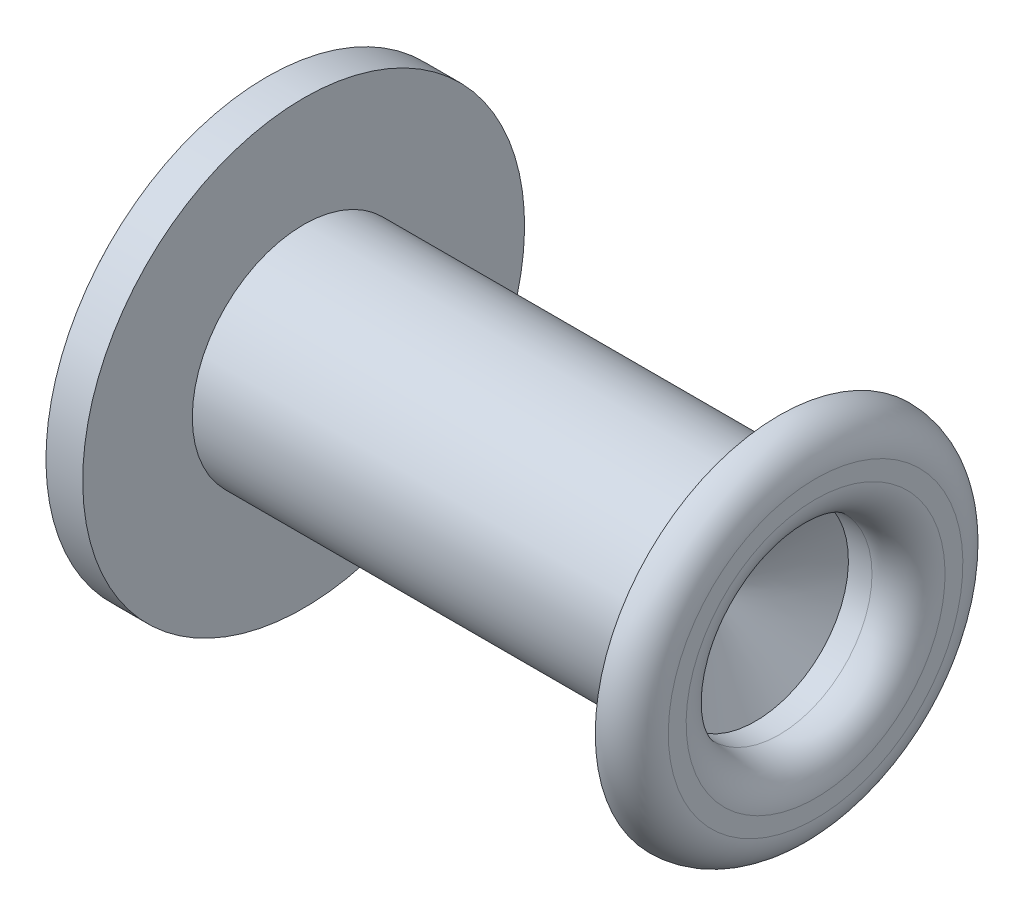
ISO-10303-21;
HEADER;
FILE_DESCRIPTION(('STEP AP214'),'2;1');
FILE_NAME('part.step','',(''),(''),'','','');
FILE_SCHEMA(('AUTOMOTIVE_DESIGN { 1 0 10303 214 1 1 1 1 }'));
ENDSEC;
DATA;
#1=APPLICATION_CONTEXT('core data for automotive mechanical design processes');
#2=APPLICATION_PROTOCOL_DEFINITION('international standard','automotive_design',2000,#1);
#3=PRODUCT_CONTEXT('',#1,'mechanical');
#4=PRODUCT('Part','Part','',(#3));
#5=PRODUCT_RELATED_PRODUCT_CATEGORY('part','',(#4));
#6=PRODUCT_DEFINITION_FORMATION('','',#4);
#7=PRODUCT_DEFINITION_CONTEXT('part definition',#1,'design');
#8=PRODUCT_DEFINITION('design','',#6,#7);
#9=PRODUCT_DEFINITION_SHAPE('','',#8);
#10=(LENGTH_UNIT() NAMED_UNIT(*) SI_UNIT(.MILLI.,.METRE.));
#11=(NAMED_UNIT(*) PLANE_ANGLE_UNIT() SI_UNIT($,.RADIAN.));
#12=(NAMED_UNIT(*) SI_UNIT($,.STERADIAN.) SOLID_ANGLE_UNIT());
#13=UNCERTAINTY_MEASURE_WITH_UNIT(LENGTH_MEASURE(1.E-05),#10,'distance_accuracy_value','');
#14=(GEOMETRIC_REPRESENTATION_CONTEXT(3) GLOBAL_UNCERTAINTY_ASSIGNED_CONTEXT((#13)) GLOBAL_UNIT_ASSIGNED_CONTEXT((#10,
#11,#12)) REPRESENTATION_CONTEXT('',''));
#15=CARTESIAN_POINT('',(0.,0.,0.));
#16=DIRECTION('',(0.,0.,1.));
#17=DIRECTION('',(1.,0.,0.));
#18=AXIS2_PLACEMENT_3D('',#15,#16,#17);
#19=CARTESIAN_POINT('',(12.1208800011914,0.,0.));
#20=DIRECTION('',(1.,0.,0.));
#21=DIRECTION('',(0.,1.,0.));
#22=AXIS2_PLACEMENT_3D('',#19,#20,#21);
#23=CONICAL_SURFACE('',#22,2.00342499931604,1.07167170262021);
#24=CARTESIAN_POINT('',(11.0286799983328,-1.70530256582424E-10,0.));
#25=VERTEX_POINT('',#24);
#26=VERTEX_LOOP('',#25);
#27=FACE_BOUND('',#26,.T.);
#28=CARTESIAN_POINT('',(12.1208800000002,0.,0.));
#29=DIRECTION('',(1.,0.,0.));
#30=DIRECTION('',(0.,1.,0.));
#31=AXIS2_PLACEMENT_3D('',#28,#29,#30);
#32=CIRCLE('',#31,2.003425);
#33=CARTESIAN_POINT('',(12.1208800000002,2.0034249999999,0.));
#34=VERTEX_POINT('',#33);
#35=EDGE_CURVE('E37',#34,#34,#32,.T.);
#36=ORIENTED_EDGE('',*,*,#35,.T.);
#37=EDGE_LOOP('',(#36));
#38=FACE_BOUND('',#37,.T.);
#39=ADVANCED_FACE('F17',(#27,#38),#23,.F.);
#40=CARTESIAN_POINT('',(12.3748800000001,0.,0.));
#41=DIRECTION('',(1.,0.,0.));
#42=DIRECTION('',(0.,1.,0.));
#43=AXIS2_PLACEMENT_3D('',#40,#41,#42);
#44=CYLINDRICAL_SURFACE('',#43,2.003425);
#45=CARTESIAN_POINT('',(12.6288800000001,-1.01585395E-13,0.));
#46=DIRECTION('',(1.,0.,0.));
#47=DIRECTION('',(0.,0.,-1.));
#48=AXIS2_PLACEMENT_3D('',#45,#46,#47);
#49=CIRCLE('',#48,2.003425);
#50=CARTESIAN_POINT('',(12.6288800000001,-1.01585395E-13,-2.003425));
#51=VERTEX_POINT('',#50);
#52=EDGE_CURVE('E39',#51,#51,#49,.F.);
#53=ORIENTED_EDGE('',*,*,#52,.F.);
#54=EDGE_LOOP('',(#53));
#55=FACE_BOUND('',#54,.T.);
#56=ORIENTED_EDGE('',*,*,#35,.F.);
#57=EDGE_LOOP('',(#56));
#58=FACE_BOUND('',#57,.T.);
#59=ADVANCED_FACE('F34',(#55,#58),#44,.F.);
#60=CARTESIAN_POINT('',(12.6288800000001,-1.01585395E-13,0.));
#61=DIRECTION('',(1.,0.,0.));
#62=DIRECTION('',(0.,0.,-1.));
#63=AXIS2_PLACEMENT_3D('',#60,#61,#62);
#64=TOROIDAL_SURFACE('',#63,2.79082500000015,0.787400000000152);
#65=CARTESIAN_POINT('',(13.4162800000002,-1.07926604364801E-13,0.));
#66=DIRECTION('',(1.,0.,0.));
#67=DIRECTION('',(0.,1.,0.));
#68=AXIS2_PLACEMENT_3D('',#65,#66,#67);
#69=CIRCLE('',#68,2.79082500000001);
#70=CARTESIAN_POINT('',(13.4162800000003,2.7908249999999,0.));
#71=VERTEX_POINT('',#70);
#72=EDGE_CURVE('E42',#71,#71,#69,.F.);
#73=ORIENTED_EDGE('',*,*,#72,.F.);
#74=EDGE_LOOP('',(#73));
#75=FACE_BOUND('',#74,.T.);
#76=ORIENTED_EDGE('',*,*,#52,.T.);
#77=EDGE_LOOP('',(#76));
#78=FACE_BOUND('',#77,.T.);
#79=ADVANCED_FACE('F98',(#75,#78),#64,.T.);
#80=CARTESIAN_POINT('',(13.4162800000003,2.98291249999985,0.));
#81=DIRECTION('',(1.,0.,0.));
#82=DIRECTION('',(0.,0.,-1.));
#83=AXIS2_PLACEMENT_3D('',#80,#81,#82);
#84=PLANE('',#83);
#85=ORIENTED_EDGE('',*,*,#72,.T.);
#86=EDGE_LOOP('',(#85));
#87=FACE_BOUND('',#86,.T.);
#88=CARTESIAN_POINT('',(13.4162800000002,-1.07926604364801E-13,0.));
#89=DIRECTION('',(-1.,0.,0.));
#90=DIRECTION('',(0.,1.,0.));
#91=AXIS2_PLACEMENT_3D('',#88,#89,#90);
#92=CIRCLE('',#91,3.17499999999991);
#93=CARTESIAN_POINT('',(13.4162800000003,3.1749999999998,0.));
#94=VERTEX_POINT('',#93);
#95=EDGE_CURVE('E62',#94,#94,#92,.T.);
#96=ORIENTED_EDGE('',*,*,#95,.F.);
#97=EDGE_LOOP('',(#96));
#98=FACE_BOUND('',#97,.T.);
#99=ADVANCED_FACE('F101',(#87,#98),#84,.T.);
#100=CARTESIAN_POINT('',(7.93750000000005,0.,0.));
#101=DIRECTION('',(1.,0.,0.));
#102=DIRECTION('',(0.,1.,0.));
#103=AXIS2_PLACEMENT_3D('',#100,#101,#102);
#104=SPHERICAL_SURFACE('',#103,7.93750000000005);
#105=CARTESIAN_POINT('',(0.,0.,0.));
#106=VERTEX_POINT('',#105);
#107=VERTEX_LOOP('',#106);
#108=FACE_BOUND('',#107,.T.);
#109=CARTESIAN_POINT('',(1.58749999999999,0.,0.));
#110=DIRECTION('',(1.,0.,0.));
#111=DIRECTION('',(0.,1.,0.));
#112=AXIS2_PLACEMENT_3D('',#109,#110,#111);
#113=CIRCLE('',#112,4.7625);
#114=CARTESIAN_POINT('',(1.58750000000003,4.76249999999999,0.));
#115=VERTEX_POINT('',#114);
#116=EDGE_CURVE('E58',#115,#115,#113,.T.);
#117=ORIENTED_EDGE('',*,*,#116,.F.);
#118=EDGE_LOOP('',(#117));
#119=FACE_BOUND('',#118,.T.);
#120=ADVANCED_FACE('F81',(#108,#119),#104,.T.);
#121=CARTESIAN_POINT('',(12.6288800000001,-1.01585395E-13,0.));
#122=DIRECTION('',(1.,0.,0.));
#123=DIRECTION('',(0.,0.,-1.));
#124=AXIS2_PLACEMENT_3D('',#121,#122,#123);
#125=TOROIDAL_SURFACE('',#124,3.17499999999975,0.787400000000152);
#126=CARTESIAN_POINT('',(12.6288800000001,-1.01585395E-13,0.));
#127=DIRECTION('',(1.,0.,0.));
#128=DIRECTION('',(0.,1.,0.));
#129=AXIS2_PLACEMENT_3D('',#126,#127,#128);
#130=CIRCLE('',#129,3.9623999999999);
#131=CARTESIAN_POINT('',(12.6288800000001,3.9623999999998,0.));
#132=VERTEX_POINT('',#131);
#133=EDGE_CURVE('E20',#132,#132,#130,.F.);
#134=ORIENTED_EDGE('',*,*,#133,.F.);
#135=EDGE_LOOP('',(#134));
#136=FACE_BOUND('',#135,.T.);
#137=ORIENTED_EDGE('',*,*,#95,.T.);
#138=EDGE_LOOP('',(#137));
#139=FACE_BOUND('',#138,.T.);
#140=ADVANCED_FACE('F75',(#136,#139),#125,.T.);
#141=CARTESIAN_POINT('',(1.9837400000001,0.,0.));
#142=DIRECTION('',(1.,0.,0.));
#143=DIRECTION('',(0.,1.,0.));
#144=AXIS2_PLACEMENT_3D('',#141,#142,#143);
#145=CYLINDRICAL_SURFACE('',#144,4.7625);
#146=ORIENTED_EDGE('',*,*,#116,.T.);
#147=EDGE_LOOP('',(#146));
#148=FACE_BOUND('',#147,.T.);
#149=CARTESIAN_POINT('',(2.37998000000022,0.,0.));
#150=DIRECTION('',(1.,0.,0.));
#151=DIRECTION('',(0.,1.,0.));
#152=AXIS2_PLACEMENT_3D('',#149,#150,#151);
#153=CIRCLE('',#152,4.7625);
#154=CARTESIAN_POINT('',(2.37998000000025,4.76249999999998,0.));
#155=VERTEX_POINT('',#154);
#156=EDGE_CURVE('E53',#155,#155,#153,.T.);
#157=ORIENTED_EDGE('',*,*,#156,.F.);
#158=EDGE_LOOP('',(#157));
#159=FACE_BOUND('',#158,.T.);
#160=ADVANCED_FACE('F80',(#148,#159),#145,.T.);
#161=CARTESIAN_POINT('',(12.6288800000001,3.18134999999985,0.));
#162=DIRECTION('',(-1.,0.,0.));
#163=DIRECTION('',(0.,0.,1.));
#164=AXIS2_PLACEMENT_3D('',#161,#162,#163);
#165=PLANE('',#164);
#166=CARTESIAN_POINT('',(12.6288800000001,-1.01704819856399E-13,0.));
#167=DIRECTION('',(1.,0.,0.));
#168=DIRECTION('',(0.,1.,0.));
#169=AXIS2_PLACEMENT_3D('',#166,#167,#168);
#170=CIRCLE('',#169,2.40030000000008);
#171=CARTESIAN_POINT('',(12.6288800000001,2.40029999999997,0.));
#172=VERTEX_POINT('',#171);
#173=EDGE_CURVE('E26',#172,#172,#170,.F.);
#174=ORIENTED_EDGE('',*,*,#173,.F.);
#175=EDGE_LOOP('',(#174));
#176=FACE_BOUND('',#175,.T.);
#177=ORIENTED_EDGE('',*,*,#133,.T.);
#178=EDGE_LOOP('',(#177));
#179=FACE_BOUND('',#178,.T.);
#180=ADVANCED_FACE('F118',(#176,#179),#165,.T.);
#181=CARTESIAN_POINT('',(2.37998000000025,3.58140000000008,0.));
#182=DIRECTION('',(1.,0.,0.));
#183=DIRECTION('',(0.,0.,-1.));
#184=AXIS2_PLACEMENT_3D('',#181,#182,#183);
#185=PLANE('',#184);
#186=CARTESIAN_POINT('',(2.37998000000024,0.,0.));
#187=DIRECTION('',(1.,0.,0.));
#188=DIRECTION('',(0.,1.,0.));
#189=AXIS2_PLACEMENT_3D('',#186,#187,#188);
#190=CIRCLE('',#189,2.40030000000008);
#191=CARTESIAN_POINT('',(2.37998000000025,2.40030000000006,0.));
#192=VERTEX_POINT('',#191);
#193=EDGE_CURVE('E11',#192,#192,#190,.T.);
#194=ORIENTED_EDGE('',*,*,#193,.F.);
#195=EDGE_LOOP('',(#194));
#196=FACE_BOUND('',#195,.T.);
#197=ORIENTED_EDGE('',*,*,#156,.T.);
#198=EDGE_LOOP('',(#197));
#199=FACE_BOUND('',#198,.T.);
#200=ADVANCED_FACE('F112',(#196,#199),#185,.T.);
#201=CARTESIAN_POINT('',(7.50443000000015,0.,0.));
#202=DIRECTION('',(1.,0.,0.));
#203=DIRECTION('',(0.,1.,0.));
#204=AXIS2_PLACEMENT_3D('',#201,#202,#203);
#205=CYLINDRICAL_SURFACE('',#204,2.40030000000008);
#206=ORIENTED_EDGE('',*,*,#193,.T.);
#207=EDGE_LOOP('',(#206));
#208=FACE_BOUND('',#207,.T.);
#209=ORIENTED_EDGE('',*,*,#173,.T.);
#210=EDGE_LOOP('',(#209));
#211=FACE_BOUND('',#210,.T.);
#212=ADVANCED_FACE('F110',(#208,#211),#205,.T.);
#213=CLOSED_SHELL('',(#39,#59,#79,#99,#120,#140,#160,#180,#200,#212));
#214=MANIFOLD_SOLID_BREP('B1',#213);
#215=ADVANCED_BREP_SHAPE_REPRESENTATION('',(#18,#214),#14);
#216=SHAPE_DEFINITION_REPRESENTATION(#9,#215);
ENDSEC;
END-ISO-10303-21;
